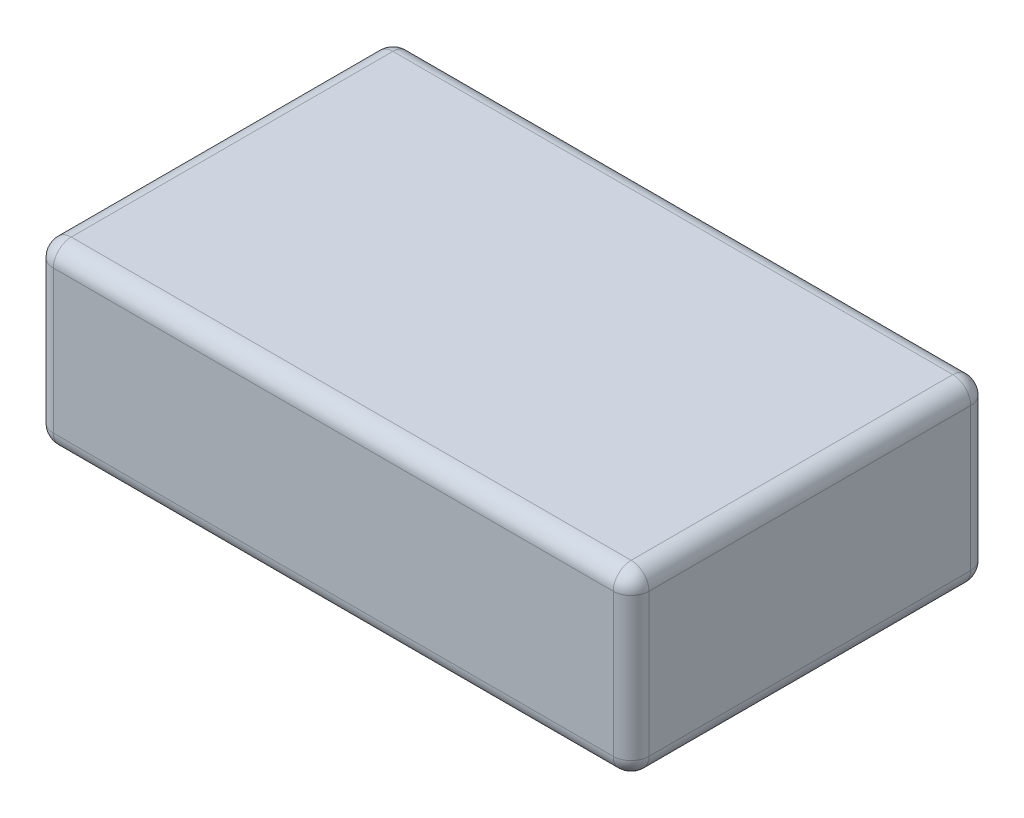
ISO-10303-21;
HEADER;
FILE_DESCRIPTION(('STEP AP214'),'2;1');
FILE_NAME('part.step','',(''),(''),'','','');
FILE_SCHEMA(('AUTOMOTIVE_DESIGN { 1 0 10303 214 1 1 1 1 }'));
ENDSEC;
DATA;
#1=APPLICATION_CONTEXT('core data for automotive mechanical design processes');
#2=APPLICATION_PROTOCOL_DEFINITION('international standard','automotive_design',2000,#1);
#3=PRODUCT_CONTEXT('',#1,'mechanical');
#4=PRODUCT('Part','Part','',(#3));
#5=PRODUCT_RELATED_PRODUCT_CATEGORY('part','',(#4));
#6=PRODUCT_DEFINITION_FORMATION('','',#4);
#7=PRODUCT_DEFINITION_CONTEXT('part definition',#1,'design');
#8=PRODUCT_DEFINITION('design','',#6,#7);
#9=PRODUCT_DEFINITION_SHAPE('','',#8);
#10=(LENGTH_UNIT() NAMED_UNIT(*) SI_UNIT(.MILLI.,.METRE.));
#11=(NAMED_UNIT(*) PLANE_ANGLE_UNIT() SI_UNIT($,.RADIAN.));
#12=(NAMED_UNIT(*) SI_UNIT($,.STERADIAN.) SOLID_ANGLE_UNIT());
#13=UNCERTAINTY_MEASURE_WITH_UNIT(LENGTH_MEASURE(1.E-05),#10,'distance_accuracy_value','');
#14=(GEOMETRIC_REPRESENTATION_CONTEXT(3) GLOBAL_UNCERTAINTY_ASSIGNED_CONTEXT((#13)) GLOBAL_UNIT_ASSIGNED_CONTEXT((#10,
#11,#12)) REPRESENTATION_CONTEXT('',''));
#15=CARTESIAN_POINT('',(0.,0.,0.));
#16=DIRECTION('',(0.,0.,1.));
#17=DIRECTION('',(1.,0.,0.));
#18=AXIS2_PLACEMENT_3D('',#15,#16,#17);
#19=CARTESIAN_POINT('',(50.,30.,30.));
#20=DIRECTION('',(-1.,0.,0.));
#21=DIRECTION('',(0.,0.,1.));
#22=AXIS2_PLACEMENT_3D('',#19,#20,#21);
#23=PLANE('',#22);
#24=DIRECTION('',(0.,-1.,0.));
#25=VECTOR('',#24,1.);
#26=CARTESIAN_POINT('',(50.,30.,27.));
#27=LINE('',#26,#25);
#28=CARTESIAN_POINT('',(50.,27.,27.));
#29=VERTEX_POINT('',#28);
#30=CARTESIAN_POINT('',(50.,3.,27.));
#31=VERTEX_POINT('',#30);
#32=EDGE_CURVE('E202',#29,#31,#27,.T.);
#33=ORIENTED_EDGE('',*,*,#32,.T.);
#34=DIRECTION('',(0.,0.,-1.));
#35=VECTOR('',#34,1.);
#36=CARTESIAN_POINT('',(50.,3.,-30.));
#37=LINE('',#36,#35);
#38=CARTESIAN_POINT('',(50.,3.,-27.));
#39=VERTEX_POINT('',#38);
#40=EDGE_CURVE('E206',#31,#39,#37,.T.);
#41=ORIENTED_EDGE('',*,*,#40,.T.);
#42=DIRECTION('',(0.,-1.,0.));
#43=VECTOR('',#42,1.);
#44=CARTESIAN_POINT('',(50.,30.,-27.));
#45=LINE('',#44,#43);
#46=CARTESIAN_POINT('',(50.,27.,-27.));
#47=VERTEX_POINT('',#46);
#48=EDGE_CURVE('E199',#39,#47,#45,.F.);
#49=ORIENTED_EDGE('',*,*,#48,.T.);
#50=DIRECTION('',(0.,0.,-1.));
#51=VECTOR('',#50,1.);
#52=CARTESIAN_POINT('',(50.,27.,30.));
#53=LINE('',#52,#51);
#54=EDGE_CURVE('E196',#47,#29,#53,.F.);
#55=ORIENTED_EDGE('',*,*,#54,.T.);
#56=EDGE_LOOP('',(#33,#41,#49,#55));
#57=FACE_BOUND('',#56,.T.);
#58=ADVANCED_FACE('F38',(#57),#23,.F.);
#59=CARTESIAN_POINT('',(-50.,30.,-30.));
#60=DIRECTION('',(0.,0.,1.));
#61=DIRECTION('',(1.,0.,0.));
#62=AXIS2_PLACEMENT_3D('',#59,#60,#61);
#63=PLANE('',#62);
#64=DIRECTION('',(0.,-1.,0.));
#65=VECTOR('',#64,1.);
#66=CARTESIAN_POINT('',(47.,30.,-30.));
#67=LINE('',#66,#65);
#68=CARTESIAN_POINT('',(47.,27.,-30.));
#69=VERTEX_POINT('',#68);
#70=CARTESIAN_POINT('',(47.,3.,-30.));
#71=VERTEX_POINT('',#70);
#72=EDGE_CURVE('E48',#69,#71,#67,.T.);
#73=ORIENTED_EDGE('',*,*,#72,.T.);
#74=DIRECTION('',(-1.,0.,0.));
#75=VECTOR('',#74,1.);
#76=CARTESIAN_POINT('',(-50.,3.,-30.));
#77=LINE('',#76,#75);
#78=CARTESIAN_POINT('',(-47.,3.,-30.));
#79=VERTEX_POINT('',#78);
#80=EDGE_CURVE('E11',#71,#79,#77,.T.);
#81=ORIENTED_EDGE('',*,*,#80,.T.);
#82=DIRECTION('',(0.,-1.,0.));
#83=VECTOR('',#82,1.);
#84=CARTESIAN_POINT('',(-47.,30.,-30.));
#85=LINE('',#84,#83);
#86=CARTESIAN_POINT('',(-47.,27.,-30.));
#87=VERTEX_POINT('',#86);
#88=EDGE_CURVE('E225',#79,#87,#85,.F.);
#89=ORIENTED_EDGE('',*,*,#88,.T.);
#90=DIRECTION('',(-1.,0.,0.));
#91=VECTOR('',#90,1.);
#92=CARTESIAN_POINT('',(-50.,27.,-30.));
#93=LINE('',#92,#91);
#94=EDGE_CURVE('E222',#87,#69,#93,.F.);
#95=ORIENTED_EDGE('',*,*,#94,.T.);
#96=EDGE_LOOP('',(#73,#81,#89,#95));
#97=FACE_BOUND('',#96,.T.);
#98=ADVANCED_FACE('F344',(#97),#63,.F.);
#99=CARTESIAN_POINT('',(-50.,30.,30.));
#100=DIRECTION('',(1.,0.,0.));
#101=DIRECTION('',(0.,0.,-1.));
#102=AXIS2_PLACEMENT_3D('',#99,#100,#101);
#103=PLANE('',#102);
#104=DIRECTION('',(0.,0.,1.));
#105=VECTOR('',#104,1.);
#106=CARTESIAN_POINT('',(-50.,3.,30.));
#107=LINE('',#106,#105);
#108=CARTESIAN_POINT('',(-50.,3.,-27.));
#109=VERTEX_POINT('',#108);
#110=CARTESIAN_POINT('',(-50.,3.,27.));
#111=VERTEX_POINT('',#110);
#112=EDGE_CURVE('E178',#109,#111,#107,.T.);
#113=ORIENTED_EDGE('',*,*,#112,.T.);
#114=DIRECTION('',(0.,-1.,0.));
#115=VECTOR('',#114,1.);
#116=CARTESIAN_POINT('',(-50.,30.,27.));
#117=LINE('',#116,#115);
#118=CARTESIAN_POINT('',(-50.,27.,27.));
#119=VERTEX_POINT('',#118);
#120=EDGE_CURVE('E135',#111,#119,#117,.F.);
#121=ORIENTED_EDGE('',*,*,#120,.T.);
#122=DIRECTION('',(0.,0.,1.));
#123=VECTOR('',#122,1.);
#124=CARTESIAN_POINT('',(-50.,27.,30.));
#125=LINE('',#124,#123);
#126=CARTESIAN_POINT('',(-50.,27.,-27.));
#127=VERTEX_POINT('',#126);
#128=EDGE_CURVE('E167',#119,#127,#125,.F.);
#129=ORIENTED_EDGE('',*,*,#128,.T.);
#130=DIRECTION('',(0.,-1.,0.));
#131=VECTOR('',#130,1.);
#132=CARTESIAN_POINT('',(-50.,30.,-27.));
#133=LINE('',#132,#131);
#134=EDGE_CURVE('E171',#127,#109,#133,.T.);
#135=ORIENTED_EDGE('',*,*,#134,.T.);
#136=EDGE_LOOP('',(#113,#121,#129,#135));
#137=FACE_BOUND('',#136,.T.);
#138=ADVANCED_FACE('F358',(#137),#103,.F.);
#139=CARTESIAN_POINT('',(-50.,30.,30.));
#140=DIRECTION('',(0.,0.,-1.));
#141=DIRECTION('',(-1.,0.,0.));
#142=AXIS2_PLACEMENT_3D('',#139,#140,#141);
#143=PLANE('',#142);
#144=DIRECTION('',(1.,0.,0.));
#145=VECTOR('',#144,1.);
#146=CARTESIAN_POINT('',(-50.,27.,30.));
#147=LINE('',#146,#145);
#148=CARTESIAN_POINT('',(47.,27.,30.));
#149=VERTEX_POINT('',#148);
#150=CARTESIAN_POINT('',(-47.,27.,30.));
#151=VERTEX_POINT('',#150);
#152=EDGE_CURVE('E164',#149,#151,#147,.F.);
#153=ORIENTED_EDGE('',*,*,#152,.T.);
#154=DIRECTION('',(0.,-1.,0.));
#155=VECTOR('',#154,1.);
#156=CARTESIAN_POINT('',(-47.,30.,30.));
#157=LINE('',#156,#155);
#158=CARTESIAN_POINT('',(-47.,3.,30.));
#159=VERTEX_POINT('',#158);
#160=EDGE_CURVE('E133',#151,#159,#157,.T.);
#161=ORIENTED_EDGE('',*,*,#160,.T.);
#162=DIRECTION('',(1.,0.,0.));
#163=VECTOR('',#162,1.);
#164=CARTESIAN_POINT('',(50.,3.,30.));
#165=LINE('',#164,#163);
#166=CARTESIAN_POINT('',(47.,3.,30.));
#167=VERTEX_POINT('',#166);
#168=EDGE_CURVE('E153',#159,#167,#165,.T.);
#169=ORIENTED_EDGE('',*,*,#168,.T.);
#170=DIRECTION('',(0.,-1.,0.));
#171=VECTOR('',#170,1.);
#172=CARTESIAN_POINT('',(47.,30.,30.));
#173=LINE('',#172,#171);
#174=EDGE_CURVE('E160',#167,#149,#173,.F.);
#175=ORIENTED_EDGE('',*,*,#174,.T.);
#176=EDGE_LOOP('',(#153,#161,#169,#175));
#177=FACE_BOUND('',#176,.T.);
#178=ADVANCED_FACE('F162',(#177),#143,.F.);
#179=CARTESIAN_POINT('',(0.,30.,0.));
#180=DIRECTION('',(0.,-1.,0.));
#181=DIRECTION('',(0.,0.,-1.));
#182=AXIS2_PLACEMENT_3D('',#179,#180,#181);
#183=PLANE('',#182);
#184=DIRECTION('',(0.,0.,1.));
#185=VECTOR('',#184,1.);
#186=CARTESIAN_POINT('',(-47.,30.,0.));
#187=LINE('',#186,#185);
#188=CARTESIAN_POINT('',(-47.,30.,-27.));
#189=VERTEX_POINT('',#188);
#190=CARTESIAN_POINT('',(-47.,30.,27.));
#191=VERTEX_POINT('',#190);
#192=EDGE_CURVE('E183',#189,#191,#187,.T.);
#193=ORIENTED_EDGE('',*,*,#192,.T.);
#194=DIRECTION('',(1.,0.,0.));
#195=VECTOR('',#194,1.);
#196=CARTESIAN_POINT('',(0.,30.,27.));
#197=LINE('',#196,#195);
#198=CARTESIAN_POINT('',(47.,30.,27.));
#199=VERTEX_POINT('',#198);
#200=EDGE_CURVE('E192',#191,#199,#197,.T.);
#201=ORIENTED_EDGE('',*,*,#200,.T.);
#202=DIRECTION('',(0.,0.,-1.));
#203=VECTOR('',#202,1.);
#204=CARTESIAN_POINT('',(47.,30.,0.));
#205=LINE('',#204,#203);
#206=CARTESIAN_POINT('',(47.,30.,-27.));
#207=VERTEX_POINT('',#206);
#208=EDGE_CURVE('E189',#199,#207,#205,.T.);
#209=ORIENTED_EDGE('',*,*,#208,.T.);
#210=DIRECTION('',(-1.,0.,0.));
#211=VECTOR('',#210,1.);
#212=CARTESIAN_POINT('',(0.,30.,-27.));
#213=LINE('',#212,#211);
#214=EDGE_CURVE('E186',#207,#189,#213,.T.);
#215=ORIENTED_EDGE('',*,*,#214,.T.);
#216=EDGE_LOOP('',(#193,#201,#209,#215));
#217=FACE_BOUND('',#216,.T.);
#218=ADVANCED_FACE('F324',(#217),#183,.F.);
#219=CARTESIAN_POINT('',(0.,0.,0.));
#220=DIRECTION('',(0.,-1.,0.));
#221=DIRECTION('',(0.,0.,-1.));
#222=AXIS2_PLACEMENT_3D('',#219,#220,#221);
#223=PLANE('',#222);
#224=DIRECTION('',(0.,0.,-1.));
#225=VECTOR('',#224,1.);
#226=CARTESIAN_POINT('',(47.,0.,30.));
#227=LINE('',#226,#225);
#228=CARTESIAN_POINT('',(47.,0.,-27.));
#229=VERTEX_POINT('',#228);
#230=CARTESIAN_POINT('',(47.,0.,27.));
#231=VERTEX_POINT('',#230);
#232=EDGE_CURVE('E212',#229,#231,#227,.F.);
#233=ORIENTED_EDGE('',*,*,#232,.T.);
#234=DIRECTION('',(1.,0.,0.));
#235=VECTOR('',#234,1.);
#236=CARTESIAN_POINT('',(-50.,0.,27.));
#237=LINE('',#236,#235);
#238=CARTESIAN_POINT('',(-47.,0.,27.));
#239=VERTEX_POINT('',#238);
#240=EDGE_CURVE('E218',#231,#239,#237,.F.);
#241=ORIENTED_EDGE('',*,*,#240,.T.);
#242=DIRECTION('',(0.,0.,1.));
#243=VECTOR('',#242,1.);
#244=CARTESIAN_POINT('',(-47.,0.,-30.));
#245=LINE('',#244,#243);
#246=CARTESIAN_POINT('',(-47.,0.,-27.));
#247=VERTEX_POINT('',#246);
#248=EDGE_CURVE('E215',#239,#247,#245,.F.);
#249=ORIENTED_EDGE('',*,*,#248,.T.);
#250=DIRECTION('',(-1.,0.,0.));
#251=VECTOR('',#250,1.);
#252=CARTESIAN_POINT('',(50.,0.,-27.));
#253=LINE('',#252,#251);
#254=EDGE_CURVE('E209',#247,#229,#253,.F.);
#255=ORIENTED_EDGE('',*,*,#254,.T.);
#256=EDGE_LOOP('',(#233,#241,#249,#255));
#257=FACE_BOUND('',#256,.T.);
#258=ADVANCED_FACE('F529',(#257),#223,.T.);
#259=CARTESIAN_POINT('',(47.,30.,-27.));
#260=DIRECTION('',(0.,-1.,0.));
#261=DIRECTION('',(0.,0.,-1.));
#262=AXIS2_PLACEMENT_3D('',#259,#260,#261);
#263=CYLINDRICAL_SURFACE('',#262,3.);
#264=CARTESIAN_POINT('',(47.,27.,-27.));
#265=DIRECTION('',(0.,1.,0.));
#266=DIRECTION('',(0.,0.,1.));
#267=AXIS2_PLACEMENT_3D('',#264,#265,#266);
#268=CIRCLE('',#267,3.);
#269=EDGE_CURVE('E42',#47,#69,#268,.T.);
#270=ORIENTED_EDGE('',*,*,#269,.F.);
#271=ORIENTED_EDGE('',*,*,#48,.F.);
#272=CARTESIAN_POINT('',(47.,3.,-27.));
#273=DIRECTION('',(0.,-1.,0.));
#274=DIRECTION('',(0.,0.,-1.));
#275=AXIS2_PLACEMENT_3D('',#272,#273,#274);
#276=CIRCLE('',#275,3.);
#277=EDGE_CURVE('E299',#71,#39,#276,.T.);
#278=ORIENTED_EDGE('',*,*,#277,.F.);
#279=ORIENTED_EDGE('',*,*,#72,.F.);
#280=EDGE_LOOP('',(#270,#271,#278,#279));
#281=FACE_BOUND('',#280,.T.);
#282=ADVANCED_FACE('F40',(#281),#263,.T.);
#283=CARTESIAN_POINT('',(47.,27.,-27.));
#284=DIRECTION('',(0.,0.,-1.));
#285=DIRECTION('',(-1.,0.,0.));
#286=AXIS2_PLACEMENT_3D('',#283,#284,#285);
#287=SPHERICAL_SURFACE('',#286,3.);
#288=CARTESIAN_POINT('',(47.,27.,-27.));
#289=DIRECTION('',(0.,0.,-1.));
#290=DIRECTION('',(-1.,0.,0.));
#291=AXIS2_PLACEMENT_3D('',#288,#289,#290);
#292=CIRCLE('',#291,3.);
#293=EDGE_CURVE('E292',#47,#207,#292,.F.);
#294=ORIENTED_EDGE('',*,*,#293,.F.);
#295=ORIENTED_EDGE('',*,*,#269,.T.);
#296=CARTESIAN_POINT('',(47.,27.,-27.));
#297=DIRECTION('',(1.,0.,0.));
#298=DIRECTION('',(0.,0.,-1.));
#299=AXIS2_PLACEMENT_3D('',#296,#297,#298);
#300=CIRCLE('',#299,3.);
#301=EDGE_CURVE('E296',#207,#69,#300,.F.);
#302=ORIENTED_EDGE('',*,*,#301,.F.);
#303=EDGE_LOOP('',(#294,#295,#302));
#304=FACE_BOUND('',#303,.T.);
#305=ADVANCED_FACE('F311',(#304),#287,.T.);
#306=CARTESIAN_POINT('',(47.,3.,-27.));
#307=DIRECTION('',(1.,0.,0.));
#308=DIRECTION('',(0.,1.,0.));
#309=AXIS2_PLACEMENT_3D('',#306,#307,#308);
#310=SPHERICAL_SURFACE('',#309,3.);
#311=CARTESIAN_POINT('',(47.,3.,-27.));
#312=DIRECTION('',(1.,0.,0.));
#313=DIRECTION('',(0.,0.,-1.));
#314=AXIS2_PLACEMENT_3D('',#311,#312,#313);
#315=CIRCLE('',#314,3.);
#316=EDGE_CURVE('E285',#71,#229,#315,.F.);
#317=ORIENTED_EDGE('',*,*,#316,.F.);
#318=ORIENTED_EDGE('',*,*,#277,.T.);
#319=CARTESIAN_POINT('',(47.,3.,-27.));
#320=DIRECTION('',(0.,0.,-1.));
#321=DIRECTION('',(-1.,0.,0.));
#322=AXIS2_PLACEMENT_3D('',#319,#320,#321);
#323=CIRCLE('',#322,3.);
#324=EDGE_CURVE('E288',#229,#39,#323,.F.);
#325=ORIENTED_EDGE('',*,*,#324,.F.);
#326=EDGE_LOOP('',(#317,#318,#325));
#327=FACE_BOUND('',#326,.T.);
#328=ADVANCED_FACE('F508',(#327),#310,.T.);
#329=CARTESIAN_POINT('',(0.,27.,-27.));
#330=DIRECTION('',(-1.,0.,0.));
#331=DIRECTION('',(0.,0.,1.));
#332=AXIS2_PLACEMENT_3D('',#329,#330,#331);
#333=CYLINDRICAL_SURFACE('',#332,3.);
#334=ORIENTED_EDGE('',*,*,#301,.T.);
#335=ORIENTED_EDGE('',*,*,#94,.F.);
#336=CARTESIAN_POINT('',(-47.,27.,-27.));
#337=DIRECTION('',(-1.,0.,0.));
#338=DIRECTION('',(0.,0.,1.));
#339=AXIS2_PLACEMENT_3D('',#336,#337,#338);
#340=CIRCLE('',#339,3.);
#341=EDGE_CURVE('E277',#189,#87,#340,.T.);
#342=ORIENTED_EDGE('',*,*,#341,.F.);
#343=ORIENTED_EDGE('',*,*,#214,.F.);
#344=EDGE_LOOP('',(#334,#335,#342,#343));
#345=FACE_BOUND('',#344,.T.);
#346=ADVANCED_FACE('F319',(#345),#333,.T.);
#347=CARTESIAN_POINT('',(47.,27.,0.));
#348=DIRECTION('',(0.,0.,-1.));
#349=DIRECTION('',(-1.,0.,0.));
#350=AXIS2_PLACEMENT_3D('',#347,#348,#349);
#351=CYLINDRICAL_SURFACE('',#350,3.);
#352=ORIENTED_EDGE('',*,*,#293,.T.);
#353=ORIENTED_EDGE('',*,*,#208,.F.);
#354=CARTESIAN_POINT('',(47.,27.,27.));
#355=DIRECTION('',(0.,0.,1.));
#356=DIRECTION('',(1.,0.,0.));
#357=AXIS2_PLACEMENT_3D('',#354,#355,#356);
#358=CIRCLE('',#357,3.);
#359=EDGE_CURVE('E273',#29,#199,#358,.T.);
#360=ORIENTED_EDGE('',*,*,#359,.F.);
#361=ORIENTED_EDGE('',*,*,#54,.F.);
#362=EDGE_LOOP('',(#352,#353,#360,#361));
#363=FACE_BOUND('',#362,.T.);
#364=ADVANCED_FACE('F330',(#363),#351,.T.);
#365=CARTESIAN_POINT('',(47.,30.,27.));
#366=DIRECTION('',(0.,-1.,0.));
#367=DIRECTION('',(0.,0.,-1.));
#368=AXIS2_PLACEMENT_3D('',#365,#366,#367);
#369=CYLINDRICAL_SURFACE('',#368,3.);
#370=CARTESIAN_POINT('',(47.,3.,27.));
#371=DIRECTION('',(0.,-1.,0.));
#372=DIRECTION('',(0.,0.,-1.));
#373=AXIS2_PLACEMENT_3D('',#370,#371,#372);
#374=CIRCLE('',#373,3.);
#375=EDGE_CURVE('E265',#31,#167,#374,.T.);
#376=ORIENTED_EDGE('',*,*,#375,.F.);
#377=ORIENTED_EDGE('',*,*,#32,.F.);
#378=CARTESIAN_POINT('',(47.,27.,27.));
#379=DIRECTION('',(0.,1.,0.));
#380=DIRECTION('',(0.,0.,1.));
#381=AXIS2_PLACEMENT_3D('',#378,#379,#380);
#382=CIRCLE('',#381,3.);
#383=EDGE_CURVE('E269',#149,#29,#382,.T.);
#384=ORIENTED_EDGE('',*,*,#383,.F.);
#385=ORIENTED_EDGE('',*,*,#174,.F.);
#386=EDGE_LOOP('',(#376,#377,#384,#385));
#387=FACE_BOUND('',#386,.T.);
#388=ADVANCED_FACE('F336',(#387),#369,.T.);
#389=CARTESIAN_POINT('',(47.,3.,30.));
#390=DIRECTION('',(0.,0.,1.));
#391=DIRECTION('',(1.,0.,0.));
#392=AXIS2_PLACEMENT_3D('',#389,#390,#391);
#393=CYLINDRICAL_SURFACE('',#392,3.);
#394=ORIENTED_EDGE('',*,*,#324,.T.);
#395=ORIENTED_EDGE('',*,*,#40,.F.);
#396=CARTESIAN_POINT('',(47.,3.,27.));
#397=DIRECTION('',(0.,0.,1.));
#398=DIRECTION('',(1.,0.,0.));
#399=AXIS2_PLACEMENT_3D('',#396,#397,#398);
#400=CIRCLE('',#399,3.);
#401=EDGE_CURVE('E262',#231,#31,#400,.T.);
#402=ORIENTED_EDGE('',*,*,#401,.F.);
#403=ORIENTED_EDGE('',*,*,#232,.F.);
#404=EDGE_LOOP('',(#394,#395,#402,#403));
#405=FACE_BOUND('',#404,.T.);
#406=ADVANCED_FACE('F342',(#405),#393,.T.);
#407=CARTESIAN_POINT('',(-50.,3.,-27.));
#408=DIRECTION('',(1.,0.,0.));
#409=DIRECTION('',(0.,0.,-1.));
#410=AXIS2_PLACEMENT_3D('',#407,#408,#409);
#411=CYLINDRICAL_SURFACE('',#410,3.);
#412=ORIENTED_EDGE('',*,*,#316,.T.);
#413=ORIENTED_EDGE('',*,*,#254,.F.);
#414=CARTESIAN_POINT('',(-47.,3.,-27.));
#415=DIRECTION('',(-1.,0.,0.));
#416=DIRECTION('',(0.,0.,1.));
#417=AXIS2_PLACEMENT_3D('',#414,#415,#416);
#418=CIRCLE('',#417,3.);
#419=EDGE_CURVE('E258',#79,#247,#418,.T.);
#420=ORIENTED_EDGE('',*,*,#419,.F.);
#421=ORIENTED_EDGE('',*,*,#80,.F.);
#422=EDGE_LOOP('',(#412,#413,#420,#421));
#423=FACE_BOUND('',#422,.T.);
#424=ADVANCED_FACE('F351',(#423),#411,.T.);
#425=CARTESIAN_POINT('',(-47.,30.,-27.));
#426=DIRECTION('',(0.,-1.,0.));
#427=DIRECTION('',(0.,0.,-1.));
#428=AXIS2_PLACEMENT_3D('',#425,#426,#427);
#429=CYLINDRICAL_SURFACE('',#428,3.);
#430=CARTESIAN_POINT('',(-47.,27.,-27.));
#431=DIRECTION('',(0.,1.,0.));
#432=DIRECTION('',(0.,0.,1.));
#433=AXIS2_PLACEMENT_3D('',#430,#431,#432);
#434=CIRCLE('',#433,3.);
#435=EDGE_CURVE('E281',#87,#127,#434,.T.);
#436=ORIENTED_EDGE('',*,*,#435,.F.);
#437=ORIENTED_EDGE('',*,*,#88,.F.);
#438=CARTESIAN_POINT('',(-47.,3.,-27.));
#439=DIRECTION('',(0.,-1.,0.));
#440=DIRECTION('',(0.,0.,-1.));
#441=AXIS2_PLACEMENT_3D('',#438,#439,#440);
#442=CIRCLE('',#441,3.);
#443=EDGE_CURVE('E254',#109,#79,#442,.T.);
#444=ORIENTED_EDGE('',*,*,#443,.F.);
#445=ORIENTED_EDGE('',*,*,#134,.F.);
#446=EDGE_LOOP('',(#436,#437,#444,#445));
#447=FACE_BOUND('',#446,.T.);
#448=ADVANCED_FACE('F347',(#447),#429,.T.);
#449=CARTESIAN_POINT('',(-47.,27.,-27.));
#450=DIRECTION('',(0.,0.,-1.));
#451=DIRECTION('',(-1.,0.,0.));
#452=AXIS2_PLACEMENT_3D('',#449,#450,#451);
#453=SPHERICAL_SURFACE('',#452,3.);
#454=ORIENTED_EDGE('',*,*,#341,.T.);
#455=ORIENTED_EDGE('',*,*,#435,.T.);
#456=CARTESIAN_POINT('',(-47.,27.,-27.));
#457=DIRECTION('',(0.,0.,-1.));
#458=DIRECTION('',(0.,1.,0.));
#459=AXIS2_PLACEMENT_3D('',#456,#457,#458);
#460=CIRCLE('',#459,3.);
#461=EDGE_CURVE('E250',#189,#127,#460,.F.);
#462=ORIENTED_EDGE('',*,*,#461,.F.);
#463=EDGE_LOOP('',(#454,#455,#462));
#464=FACE_BOUND('',#463,.T.);
#465=ADVANCED_FACE('F361',(#464),#453,.T.);
#466=CARTESIAN_POINT('',(47.,27.,27.));
#467=DIRECTION('',(1.,0.,0.));
#468=DIRECTION('',(0.,0.,-1.));
#469=AXIS2_PLACEMENT_3D('',#466,#467,#468);
#470=SPHERICAL_SURFACE('',#469,3.);
#471=ORIENTED_EDGE('',*,*,#383,.T.);
#472=ORIENTED_EDGE('',*,*,#359,.T.);
#473=CARTESIAN_POINT('',(47.,27.,27.));
#474=DIRECTION('',(1.,0.,0.));
#475=DIRECTION('',(0.,0.,-1.));
#476=AXIS2_PLACEMENT_3D('',#473,#474,#475);
#477=CIRCLE('',#476,3.);
#478=EDGE_CURVE('E247',#149,#199,#477,.F.);
#479=ORIENTED_EDGE('',*,*,#478,.F.);
#480=EDGE_LOOP('',(#471,#472,#479));
#481=FACE_BOUND('',#480,.T.);
#482=ADVANCED_FACE('F371',(#481),#470,.T.);
#483=CARTESIAN_POINT('',(47.,3.,27.));
#484=DIRECTION('',(1.,0.,0.));
#485=DIRECTION('',(0.,1.,0.));
#486=AXIS2_PLACEMENT_3D('',#483,#484,#485);
#487=SPHERICAL_SURFACE('',#486,3.);
#488=ORIENTED_EDGE('',*,*,#401,.T.);
#489=ORIENTED_EDGE('',*,*,#375,.T.);
#490=CARTESIAN_POINT('',(47.,3.,27.));
#491=DIRECTION('',(1.,0.,0.));
#492=DIRECTION('',(0.,0.,-1.));
#493=AXIS2_PLACEMENT_3D('',#490,#491,#492);
#494=CIRCLE('',#493,3.);
#495=EDGE_CURVE('E156',#231,#167,#494,.F.);
#496=ORIENTED_EDGE('',*,*,#495,.F.);
#497=EDGE_LOOP('',(#488,#489,#496));
#498=FACE_BOUND('',#497,.T.);
#499=ADVANCED_FACE('F373',(#498),#487,.T.);
#500=CARTESIAN_POINT('',(-47.,3.,-27.));
#501=DIRECTION('',(0.,0.,-1.));
#502=DIRECTION('',(0.,1.,0.));
#503=AXIS2_PLACEMENT_3D('',#500,#501,#502);
#504=SPHERICAL_SURFACE('',#503,3.);
#505=ORIENTED_EDGE('',*,*,#443,.T.);
#506=ORIENTED_EDGE('',*,*,#419,.T.);
#507=CARTESIAN_POINT('',(-47.,3.,-27.));
#508=DIRECTION('',(0.,0.,-1.));
#509=DIRECTION('',(-1.,0.,0.));
#510=AXIS2_PLACEMENT_3D('',#507,#508,#509);
#511=CIRCLE('',#510,3.);
#512=EDGE_CURVE('E241',#109,#247,#511,.F.);
#513=ORIENTED_EDGE('',*,*,#512,.F.);
#514=EDGE_LOOP('',(#505,#506,#513));
#515=FACE_BOUND('',#514,.T.);
#516=ADVANCED_FACE('F353',(#515),#504,.T.);
#517=CARTESIAN_POINT('',(-47.,27.,0.));
#518=DIRECTION('',(0.,0.,1.));
#519=DIRECTION('',(1.,0.,0.));
#520=AXIS2_PLACEMENT_3D('',#517,#518,#519);
#521=CYLINDRICAL_SURFACE('',#520,3.);
#522=ORIENTED_EDGE('',*,*,#461,.T.);
#523=ORIENTED_EDGE('',*,*,#128,.F.);
#524=CARTESIAN_POINT('',(-47.,27.,27.));
#525=DIRECTION('',(0.,0.,1.));
#526=DIRECTION('',(1.,0.,0.));
#527=AXIS2_PLACEMENT_3D('',#524,#525,#526);
#528=CIRCLE('',#527,3.);
#529=EDGE_CURVE('E237',#191,#119,#528,.T.);
#530=ORIENTED_EDGE('',*,*,#529,.F.);
#531=ORIENTED_EDGE('',*,*,#192,.F.);
#532=EDGE_LOOP('',(#522,#523,#530,#531));
#533=FACE_BOUND('',#532,.T.);
#534=ADVANCED_FACE('F363',(#533),#521,.T.);
#535=CARTESIAN_POINT('',(0.,27.,27.));
#536=DIRECTION('',(1.,0.,0.));
#537=DIRECTION('',(0.,0.,-1.));
#538=AXIS2_PLACEMENT_3D('',#535,#536,#537);
#539=CYLINDRICAL_SURFACE('',#538,3.);
#540=ORIENTED_EDGE('',*,*,#478,.T.);
#541=ORIENTED_EDGE('',*,*,#200,.F.);
#542=CARTESIAN_POINT('',(-47.,27.,27.));
#543=DIRECTION('',(-1.,0.,0.));
#544=DIRECTION('',(0.,0.,1.));
#545=AXIS2_PLACEMENT_3D('',#542,#543,#544);
#546=CIRCLE('',#545,3.);
#547=EDGE_CURVE('E150',#151,#191,#546,.T.);
#548=ORIENTED_EDGE('',*,*,#547,.F.);
#549=ORIENTED_EDGE('',*,*,#152,.F.);
#550=EDGE_LOOP('',(#540,#541,#548,#549));
#551=FACE_BOUND('',#550,.T.);
#552=ADVANCED_FACE('F369',(#551),#539,.T.);
#553=CARTESIAN_POINT('',(-50.,3.,27.));
#554=DIRECTION('',(-1.,0.,0.));
#555=DIRECTION('',(0.,0.,1.));
#556=AXIS2_PLACEMENT_3D('',#553,#554,#555);
#557=CYLINDRICAL_SURFACE('',#556,3.);
#558=ORIENTED_EDGE('',*,*,#495,.T.);
#559=ORIENTED_EDGE('',*,*,#168,.F.);
#560=CARTESIAN_POINT('',(-47.,3.,27.));
#561=DIRECTION('',(-1.,0.,0.));
#562=DIRECTION('',(0.,0.,1.));
#563=AXIS2_PLACEMENT_3D('',#560,#561,#562);
#564=CIRCLE('',#563,3.);
#565=EDGE_CURVE('E141',#239,#159,#564,.T.);
#566=ORIENTED_EDGE('',*,*,#565,.F.);
#567=ORIENTED_EDGE('',*,*,#240,.F.);
#568=EDGE_LOOP('',(#558,#559,#566,#567));
#569=FACE_BOUND('',#568,.T.);
#570=ADVANCED_FACE('F154',(#569),#557,.T.);
#571=CARTESIAN_POINT('',(-47.,3.,30.));
#572=DIRECTION('',(0.,0.,-1.));
#573=DIRECTION('',(-1.,0.,0.));
#574=AXIS2_PLACEMENT_3D('',#571,#572,#573);
#575=CYLINDRICAL_SURFACE('',#574,3.);
#576=ORIENTED_EDGE('',*,*,#512,.T.);
#577=ORIENTED_EDGE('',*,*,#248,.F.);
#578=CARTESIAN_POINT('',(-47.,3.,27.));
#579=DIRECTION('',(0.,0.,1.));
#580=DIRECTION('',(1.,0.,0.));
#581=AXIS2_PLACEMENT_3D('',#578,#579,#580);
#582=CIRCLE('',#581,3.);
#583=EDGE_CURVE('E145',#111,#239,#582,.T.);
#584=ORIENTED_EDGE('',*,*,#583,.F.);
#585=ORIENTED_EDGE('',*,*,#112,.F.);
#586=EDGE_LOOP('',(#576,#577,#584,#585));
#587=FACE_BOUND('',#586,.T.);
#588=ADVANCED_FACE('F356',(#587),#575,.T.);
#589=CARTESIAN_POINT('',(-47.,27.,27.));
#590=DIRECTION('',(0.,1.,0.));
#591=DIRECTION('',(0.,0.,1.));
#592=AXIS2_PLACEMENT_3D('',#589,#590,#591);
#593=SPHERICAL_SURFACE('',#592,3.);
#594=ORIENTED_EDGE('',*,*,#547,.T.);
#595=ORIENTED_EDGE('',*,*,#529,.T.);
#596=CARTESIAN_POINT('',(-47.,27.,27.));
#597=DIRECTION('',(0.,1.,0.));
#598=DIRECTION('',(0.,0.,1.));
#599=AXIS2_PLACEMENT_3D('',#596,#597,#598);
#600=CIRCLE('',#599,3.);
#601=EDGE_CURVE('E138',#151,#119,#600,.F.);
#602=ORIENTED_EDGE('',*,*,#601,.F.);
#603=EDGE_LOOP('',(#594,#595,#602));
#604=FACE_BOUND('',#603,.T.);
#605=ADVANCED_FACE('F367',(#604),#593,.T.);
#606=CARTESIAN_POINT('',(-47.,3.,27.));
#607=DIRECTION('',(0.,-1.,0.));
#608=DIRECTION('',(0.,0.,-1.));
#609=AXIS2_PLACEMENT_3D('',#606,#607,#608);
#610=SPHERICAL_SURFACE('',#609,3.);
#611=ORIENTED_EDGE('',*,*,#583,.T.);
#612=ORIENTED_EDGE('',*,*,#565,.T.);
#613=CARTESIAN_POINT('',(-47.,3.,27.));
#614=DIRECTION('',(0.,-1.,0.));
#615=DIRECTION('',(0.,0.,-1.));
#616=AXIS2_PLACEMENT_3D('',#613,#614,#615);
#617=CIRCLE('',#616,3.);
#618=EDGE_CURVE('E129',#111,#159,#617,.F.);
#619=ORIENTED_EDGE('',*,*,#618,.F.);
#620=EDGE_LOOP('',(#611,#612,#619));
#621=FACE_BOUND('',#620,.T.);
#622=ADVANCED_FACE('F143',(#621),#610,.T.);
#623=CARTESIAN_POINT('',(-47.,30.,27.));
#624=DIRECTION('',(0.,-1.,0.));
#625=DIRECTION('',(0.,0.,-1.));
#626=AXIS2_PLACEMENT_3D('',#623,#624,#625);
#627=CYLINDRICAL_SURFACE('',#626,3.);
#628=ORIENTED_EDGE('',*,*,#601,.T.);
#629=ORIENTED_EDGE('',*,*,#120,.F.);
#630=ORIENTED_EDGE('',*,*,#618,.T.);
#631=ORIENTED_EDGE('',*,*,#160,.F.);
#632=EDGE_LOOP('',(#628,#629,#630,#631));
#633=FACE_BOUND('',#632,.T.);
#634=ADVANCED_FACE('F131',(#633),#627,.T.);
#635=CLOSED_SHELL('',(#58,#98,#138,#178,#218,#258,#282,#305,#328,#346,#364,#388,#406,#424,#448,
#465,#482,#499,#516,#534,#552,#570,#588,#605,#622,#634));
#636=MANIFOLD_SOLID_BREP('B2',#635);
#637=ADVANCED_BREP_SHAPE_REPRESENTATION('',(#18,#636),#14);
#638=SHAPE_DEFINITION_REPRESENTATION(#9,#637);
ENDSEC;
END-ISO-10303-21;
